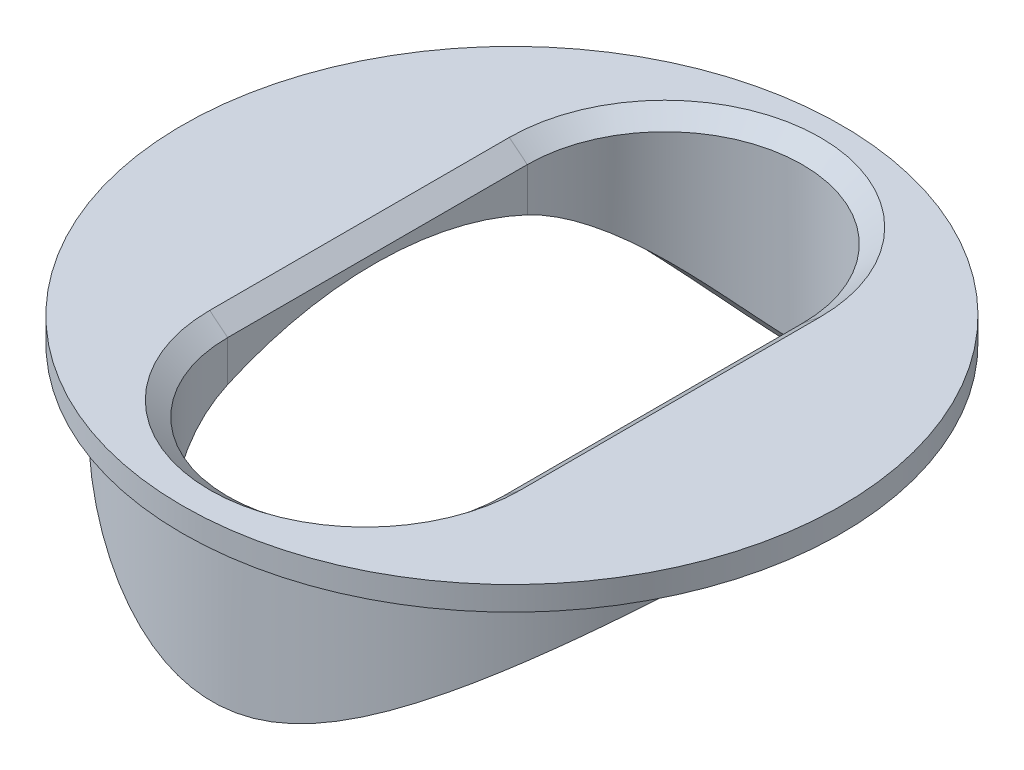
ISO-10303-21;
HEADER;
FILE_DESCRIPTION(('STEP AP214'),'2;1');
FILE_NAME('part.step','',(''),(''),'','','');
FILE_SCHEMA(('AUTOMOTIVE_DESIGN { 1 0 10303 214 1 1 1 1 }'));
ENDSEC;
DATA;
#1=APPLICATION_CONTEXT('core data for automotive mechanical design processes');
#2=APPLICATION_PROTOCOL_DEFINITION('international standard','automotive_design',2000,#1);
#3=PRODUCT_CONTEXT('',#1,'mechanical');
#4=PRODUCT('Part','Part','',(#3));
#5=PRODUCT_RELATED_PRODUCT_CATEGORY('part','',(#4));
#6=PRODUCT_DEFINITION_FORMATION('','',#4);
#7=PRODUCT_DEFINITION_CONTEXT('part definition',#1,'design');
#8=PRODUCT_DEFINITION('design','',#6,#7);
#9=PRODUCT_DEFINITION_SHAPE('','',#8);
#10=(LENGTH_UNIT() NAMED_UNIT(*) SI_UNIT(.MILLI.,.METRE.));
#11=(NAMED_UNIT(*) PLANE_ANGLE_UNIT() SI_UNIT($,.RADIAN.));
#12=(NAMED_UNIT(*) SI_UNIT($,.STERADIAN.) SOLID_ANGLE_UNIT());
#13=UNCERTAINTY_MEASURE_WITH_UNIT(LENGTH_MEASURE(1.E-05),#10,'distance_accuracy_value','');
#14=(GEOMETRIC_REPRESENTATION_CONTEXT(3) GLOBAL_UNCERTAINTY_ASSIGNED_CONTEXT((#13)) GLOBAL_UNIT_ASSIGNED_CONTEXT((#10,
#11,#12)) REPRESENTATION_CONTEXT('',''));
#15=CARTESIAN_POINT('',(0.,0.,0.));
#16=DIRECTION('',(0.,0.,1.));
#17=DIRECTION('',(1.,0.,0.));
#18=AXIS2_PLACEMENT_3D('',#15,#16,#17);
#19=CARTESIAN_POINT('',(0.,5.,0.));
#20=DIRECTION('',(0.,-1.,0.));
#21=DIRECTION('',(0.,0.,-1.));
#22=AXIS2_PLACEMENT_3D('',#19,#20,#21);
#23=CYLINDRICAL_SURFACE('',#22,5.);
#24=CARTESIAN_POINT('',(0.,5.,0.));
#25=DIRECTION('',(0.,1.,0.));
#26=DIRECTION('',(0.,0.,1.));
#27=AXIS2_PLACEMENT_3D('',#24,#25,#26);
#28=CIRCLE('',#27,5.);
#29=CARTESIAN_POINT('',(5.,5.,0.));
#30=VERTEX_POINT('',#29);
#31=CARTESIAN_POINT('',(-5.00000000000002,5.00000000000002,0.));
#32=VERTEX_POINT('',#31);
#33=EDGE_CURVE('E104',#30,#32,#28,.T.);
#34=ORIENTED_EDGE('',*,*,#33,.F.);
#35=CARTESIAN_POINT('',(5.,5.,0.));
#36=CARTESIAN_POINT('',(5.0000064862677,5.00000636279643,-0.118803401095405));
#37=CARTESIAN_POINT('',(4.99576243276274,4.9964675633917,-0.237558182871218));
#38=CARTESIAN_POINT('',(4.97888342242901,4.98241218121961,-0.474087838067091));
#39=CARTESIAN_POINT('',(4.96624750352265,4.97189479839916,-0.591862597565708));
#40=CARTESIAN_POINT('',(4.93280067838579,4.94410935213455,-0.825474733693953));
#41=CARTESIAN_POINT('',(4.9119867768663,4.92683881527392,-0.941311384241482));
#42=CARTESIAN_POINT('',(4.86255145148515,4.88593383048318,-1.17018155731566));
#43=CARTESIAN_POINT('',(4.83392655878944,4.86229655516696,-1.28321381003106));
#44=CARTESIAN_POINT('',(4.73740362240781,4.78287450226039,-1.61550772291657));
#45=CARTESIAN_POINT('',(4.65860789353558,4.71836951829061,-1.82964493287683));
#46=CARTESIAN_POINT('',(4.47594785576944,4.57056793109677,-2.23973970904936));
#47=CARTESIAN_POINT('',(4.37207507698347,4.48726497939233,-2.43569110189251));
#48=CARTESIAN_POINT('',(4.17931765246547,4.33520303254702,-2.7487493551036));
#49=CARTESIAN_POINT('',(4.09605321766379,4.27015451867263,-2.87121824175386));
#50=CARTESIAN_POINT('',(3.92057491487891,4.13495608214751,-3.10654667374618));
#51=CARTESIAN_POINT('',(3.82836116355909,4.06480622600091,-3.21940634431806));
#52=CARTESIAN_POINT('',(3.63553308278675,3.92066908923446,-3.43568816068562));
#53=CARTESIAN_POINT('',(3.53489678957743,3.84667197890407,-3.53908406033977));
#54=CARTESIAN_POINT('',(3.32600704379389,3.69649318853079,-3.73607907111508));
#55=CARTESIAN_POINT('',(3.21775455132494,3.62031178455679,-3.82967941338621));
#56=CARTESIAN_POINT('',(2.99186847524311,3.46590940619064,-4.00872533168449));
#57=CARTESIAN_POINT('',(2.87409893732901,3.38767669457347,-4.09398918746846));
#58=CARTESIAN_POINT('',(2.63097870098595,3.23240914046916,-4.25431125048952));
#59=CARTESIAN_POINT('',(2.50562548412932,3.15537470670733,-4.32936604026974));
#60=CARTESIAN_POINT('',(2.24746866950541,3.0050115613057,-4.46882104937819));
#61=CARTESIAN_POINT('',(2.11468364253878,2.93167441297209,-4.53324636625595));
#62=CARTESIAN_POINT('',(1.84110422364287,2.79155403229088,-4.65107409789267));
#63=CARTESIAN_POINT('',(1.70031678782893,2.72476524134072,-4.70448590476211));
#64=CARTESIAN_POINT('',(1.39667622874439,2.59583630496641,-4.8038705578035));
#65=CARTESIAN_POINT('',(1.23299156369287,2.53471789619366,-4.8486776643058));
#66=CARTESIAN_POINT('',(0.896180811817696,2.43187191424553,-4.92202476595886));
#67=CARTESIAN_POINT('',(0.723078773763431,2.39009732197607,-4.95060424437364));
#68=CARTESIAN_POINT('',(0.457661896369308,2.34688431376343,-4.97982440219376));
#69=CARTESIAN_POINT('',(0.367618679010188,2.33571370000033,-4.98729261982802));
#70=CARTESIAN_POINT('',(0.186635888055952,2.3206515347262,-4.99733565959028));
#71=CARTESIAN_POINT('',(0.095696399075067,2.31675930257913,-4.99991093928053));
#72=CARTESIAN_POINT('',(-0.0861953552895069,2.31649708247112,-5.00008454722765));
#73=CARTESIAN_POINT('',(-0.177147620700307,2.32012711072076,-4.99768286475912));
#74=CARTESIAN_POINT('',(-0.358199787378119,2.33469045716225,-4.98797701095387));
#75=CARTESIAN_POINT('',(-0.448299583463619,2.34562466496004,-4.9806722424497));
#76=CARTESIAN_POINT('',(-0.634290345987522,2.37538324774709,-4.9605577711742));
#77=CARTESIAN_POINT('',(-0.730044329719768,2.3947851529219,-4.94734291419499));
#78=CARTESIAN_POINT('',(-0.919072038911221,2.44038747060614,-4.9157405398429));
#79=CARTESIAN_POINT('',(-1.01234395824117,2.46659269219059,-4.89734936269663));
#80=CARTESIAN_POINT('',(-1.28826795172829,2.55374344299518,-4.83487145070514));
#81=CARTESIAN_POINT('',(-1.46664526370663,2.62315426397916,-4.78352415648848));
#82=CARTESIAN_POINT('',(-1.77568076874676,2.76004871810486,-4.67632227850057));
#83=CARTESIAN_POINT('',(-1.90862269999419,2.82500795712383,-4.62355194613133));
#84=CARTESIAN_POINT('',(-2.16730339944136,2.96043831206373,-4.50808681272012));
#85=CARTESIAN_POINT('',(-2.29303788433664,3.03091264789804,-4.44538619181528));
#86=CARTESIAN_POINT('',(-2.53766285158917,3.17491879023624,-4.31043075762212));
#87=CARTESIAN_POINT('',(-2.65654383781025,3.24845460689311,-4.23816312441515));
#88=CARTESIAN_POINT('',(-2.88743564285202,3.39652708661221,-4.08435401417139));
#89=CARTESIAN_POINT('',(-2.99944783455588,3.47106354601934,-4.00281439970954));
#90=CARTESIAN_POINT('',(-3.22226109628928,3.62342077684068,-3.82600354374306));
#91=CARTESIAN_POINT('',(-3.33269201981388,3.70120929265264,-3.73023700414124));
#92=CARTESIAN_POINT('',(-3.54559939981486,3.85446404087318,-3.52848927170201));
#93=CARTESIAN_POINT('',(-3.64807467199064,3.92992992652313,-3.42250656330085));
#94=CARTESIAN_POINT('',(-3.84425294796649,4.07681645366273,-3.20056123189973));
#95=CARTESIAN_POINT('',(-3.93797365950211,4.14824514018382,-3.08461970676717));
#96=CARTESIAN_POINT('',(-4.11599426421235,4.28566109460446,-2.84274064052496));
#97=CARTESIAN_POINT('',(-4.20029381312783,4.35164816363854,-2.71680273442447));
#98=CARTESIAN_POINT('',(-4.39878554184217,4.50853314592501,-2.38827463214803));
#99=CARTESIAN_POINT('',(-4.50631929530225,4.59498946786027,-2.17932731194452));
#100=CARTESIAN_POINT('',(-4.64613821914312,4.7084038705407,-1.8513717036081));
#101=CARTESIAN_POINT('',(-4.68917312218695,4.74350440601256,-1.73959798407546));
#102=CARTESIAN_POINT('',(-4.76751793421716,4.80764297166477,-1.51170856686385));
#103=CARTESIAN_POINT('',(-4.80283171060456,4.83668403661189,-1.39559507719868));
#104=CARTESIAN_POINT('',(-4.86543453319277,4.88830518104936,-1.15874024023432));
#105=CARTESIAN_POINT('',(-4.89265476556204,4.91082981449133,-1.03796855116843));
#106=CARTESIAN_POINT('',(-4.93816722227972,4.94855722519953,-0.793680719841944));
#107=CARTESIAN_POINT('',(-4.9564638664516,4.96376362711192,-0.670165967971713));
#108=CARTESIAN_POINT('',(-4.98377697031546,4.98648272603519,-0.421443909131275));
#109=CARTESIAN_POINT('',(-4.99279601788868,4.99399756851713,-0.296237084023912));
#110=CARTESIAN_POINT('',(-5.00137053830483,5.00114166173048,-0.0452813606587532));
#111=CARTESIAN_POINT('',(-5.00092704086014,5.00077177047715,0.0804674771283918));
#112=CARTESIAN_POINT('',(-4.9912131909085,4.99267919208227,0.316217699577991));
#113=CARTESIAN_POINT('',(-4.98300958868131,4.98584511760915,0.426296149457824));
#114=CARTESIAN_POINT('',(-4.95942180024422,4.96622340308935,0.645178571447259));
#115=CARTESIAN_POINT('',(-4.94403538382096,4.95343391393135,0.753982136950653));
#116=CARTESIAN_POINT('',(-4.90632392627914,4.922153588973,0.969508932578345));
#117=CARTESIAN_POINT('',(-4.88400108118507,4.90366455762227,1.07623280976896));
#118=CARTESIAN_POINT('',(-4.83274114539643,4.86132925877314,1.28701083316512));
#119=CARTESIAN_POINT('',(-4.80380153552005,4.83748095091222,1.39106394571243));
#120=CARTESIAN_POINT('',(-4.70677908129298,4.75780997966539,1.70100357204864));
#121=CARTESIAN_POINT('',(-4.62897463511253,4.69426548906173,1.90197317990273));
#122=CARTESIAN_POINT('',(-4.45119251532421,4.55070829820292,2.28736622034062));
#123=CARTESIAN_POINT('',(-4.35120664535608,4.47068951124314,2.47178350112441));
#124=CARTESIAN_POINT('',(-4.16241303362757,4.32196402989804,2.77431022087587));
#125=CARTESIAN_POINT('',(-4.07807881363138,4.25618753965956,2.89671891082123));
#126=CARTESIAN_POINT('',(-3.90043631108394,4.11958730343164,3.13182124456801));
#127=CARTESIAN_POINT('',(-3.8071276888363,4.04876336641404,3.24451452031805));
#128=CARTESIAN_POINT('',(-3.61204642318573,3.90332909910819,3.46039828484842));
#129=CARTESIAN_POINT('',(-3.51024916115611,3.82870801884464,3.5635591655786));
#130=CARTESIAN_POINT('',(-3.29899388009149,3.67738428016308,3.75997885952875));
#131=CARTESIAN_POINT('',(-3.18953694443025,3.60068191705467,3.85323906840847));
#132=CARTESIAN_POINT('',(-2.96121350414877,3.44540721169772,4.03144708201688));
#133=CARTESIAN_POINT('',(-2.84221365304651,3.3668259708409,4.11621624228699));
#134=CARTESIAN_POINT('',(-2.59654816531046,3.21106013919063,4.27543853436326));
#135=CARTESIAN_POINT('',(-2.46987979366073,3.13387605960317,4.34988795406829));
#136=CARTESIAN_POINT('',(-2.20902653418021,2.98352281099523,4.48797579821677));
#137=CARTESIAN_POINT('',(-2.07486275313425,2.91034341321279,4.55164272839413));
#138=CARTESIAN_POINT('',(-1.79841659242433,2.77095158572992,4.66777738062599));
#139=CARTESIAN_POINT('',(-1.65614180525609,2.70473280033071,4.72025536508449));
#140=CARTESIAN_POINT('',(-1.35146946258281,2.57850891369613,4.81674752553354));
#141=CARTESIAN_POINT('',(-1.18836978046224,2.51940536010279,4.85976816309609));
#142=CARTESIAN_POINT('',(-0.853057506761583,2.42087013106355,4.92964324178358));
#143=CARTESIAN_POINT('',(-0.680868858020006,2.38138936984465,4.95653805629938));
#144=CARTESIAN_POINT('',(-0.417267118823405,2.34161185607347,4.98335884043903));
#145=CARTESIAN_POINT('',(-0.327939885729355,2.33159299706687,4.9900439743412));
#146=CARTESIAN_POINT('',(-0.148522532583938,2.31874657694375,4.99859875462369));
#147=CARTESIAN_POINT('',(-0.058432477219266,2.31591841207014,5.00046880529626));
#148=CARTESIAN_POINT('',(0.121644228189409,2.31763235091844,4.99933140644563));
#149=CARTESIAN_POINT('',(0.211630875727309,2.32217462964556,4.99632384110741));
#150=CARTESIAN_POINT('',(0.390705731690935,2.33836659549378,4.98551920595953));
#151=CARTESIAN_POINT('',(0.479793444537635,2.3500200062847,4.97771962684741));
#152=CARTESIAN_POINT('',(0.665670000297211,2.38139896959306,4.95646386284238));
#153=CARTESIAN_POINT('',(0.762277582327926,2.40184751901396,4.94249693749092));
#154=CARTESIAN_POINT('',(0.952897655384549,2.44956299936088,4.90931375512976));
#155=CARTESIAN_POINT('',(1.0469082017716,2.47683489368278,4.89009367595844));
#156=CARTESIAN_POINT('',(1.32490519247802,2.56715037769762,4.82502893529808));
#157=CARTESIAN_POINT('',(1.50447425917309,2.6386203494625,4.77182601328659));
#158=CARTESIAN_POINT('',(1.81560530153227,2.77905708413608,4.66101333620414));
#159=CARTESIAN_POINT('',(1.94948557461559,2.84555788327452,4.60651894445034));
#160=CARTESIAN_POINT('',(2.2098947178368,2.98390215298828,4.48741065580201));
#161=CARTESIAN_POINT('',(2.33641925480245,3.05574871700043,4.42279087534715));
#162=CARTESIAN_POINT('',(2.5824750393764,3.20230923095867,4.28378589016389));
#163=CARTESIAN_POINT('',(2.70199665984665,3.27702690475068,4.20938767793865));
#164=CARTESIAN_POINT('',(2.93399936330057,3.42725084654705,4.05109347216149));
#165=CARTESIAN_POINT('',(3.0464818589428,3.50275695275141,3.96719939385687));
#166=CARTESIAN_POINT('',(3.26970299172246,3.65661946215908,3.7855972859226));
#167=CARTESIAN_POINT('',(3.38008420704471,3.73493356113398,3.6874129720634));
#168=CARTESIAN_POINT('',(3.59266286414693,3.88895347699911,3.48062708656673));
#169=CARTESIAN_POINT('',(3.69485901563602,3.96465888158806,3.37202387840541));
#170=CARTESIAN_POINT('',(3.89018127821457,4.11169145947056,3.14465963115798));
#171=CARTESIAN_POINT('',(3.98332637820863,4.1830276775675,3.02592088507467));
#172=CARTESIAN_POINT('',(4.15984718243081,4.31988980472138,2.77827797167402));
#173=CARTESIAN_POINT('',(4.24322187964873,4.38541511469401,2.64937275881185));
#174=CARTESIAN_POINT('',(4.43658392581488,4.53880075702302,2.31715775505749));
#175=CARTESIAN_POINT('',(4.54010823809411,4.62226392609454,2.1078590133521));
#176=CARTESIAN_POINT('',(4.67390583373137,4.73103285742108,1.78004652854697));
#177=CARTESIAN_POINT('',(4.71491832045558,4.7645471565668,1.66848545194811));
#178=CARTESIAN_POINT('',(4.78927419077675,4.82552080229896,1.44122911865483));
#179=CARTESIAN_POINT('',(4.8226186393853,4.85298098971731,1.3255344386574));
#180=CARTESIAN_POINT('',(4.90034346391484,4.91714489125081,1.01333234603958));
#181=CARTESIAN_POINT('',(4.93754678243697,4.94804013902009,0.813745597053209));
#182=CARTESIAN_POINT('',(4.98736819813601,4.98946116455115,0.409390797411382));
#183=CARTESIAN_POINT('',(4.99998882825427,4.99998904091734,0.204623282772272));
#184=CARTESIAN_POINT('',(5.,5.,0.));
#185=B_SPLINE_CURVE_WITH_KNOTS('',3,(#35,#36,#37,#38,#39,#40,#41,#42,#43,#44,#45,#46,#47,#48,
#49,#50,#51,#52,#53,#54,#55,#56,#57,#58,#59,#60,#61,#62,#63,#64,#65,#66,#67,#68,#69,#70,#71,#72,
#73,#74,#75,#76,#77,#78,#79,#80,#81,#82,#83,#84,#85,#86,#87,#88,#89,#90,#91,#92,#93,#94,#95,#96,
#97,#98,#99,#100,#101,#102,#103,#104,#105,#106,#107,#108,#109,#110,#111,#112,#113,#114,#115,
#116,#117,#118,#119,#120,#121,#122,#123,#124,#125,#126,#127,#128,#129,#130,#131,#132,#133,#134,
#135,#136,#137,#138,#139,#140,#141,#142,#143,#144,#145,#146,#147,#148,#149,#150,#151,#152,#153,
#154,#155,#156,#157,#158,#159,#160,#161,#162,#163,#164,#165,#166,#167,#168,#169,#170,#171,#172,
#173,#174,#175,#176,#177,#178,#179,#180,#181,#182,#183,#184),.UNSPECIFIED.,.T.,.F.,(4,2,2,2,2,2,
2,2,2,2,2,2,2,2,2,2,2,2,2,2,2,2,2,2,2,2,2,2,2,2,2,2,2,2,2,2,2,2,2,2,2,2,2,2,2,2,2,2,2,2,2,2,2,2,
2,2,2,2,2,2,2,2,2,2,2,2,2,2,2,2,2,2,2,2,4),(0.,0.356198531128419,0.712437905356867,
1.06880787854775,1.42533637270188,2.13333209783898,2.84156728725027,3.32622201622343,
3.81087042808177,4.29682459639559,4.78271761425373,5.27755036039961,5.77254834493272,
6.26636031071477,6.75974940543413,7.29936255278482,7.83765708456692,8.11040822806103,
8.38313386402394,8.65586008771504,8.92861953390792,9.22392701856221,9.51944381892724,
10.1116379066242,10.5823769120489,11.0533928323055,11.5250464324407,11.9966054526408,
12.4928422896337,12.9891528567514,13.484436760364,13.9797387562551,14.7274446962693,
15.1015034988401,15.4753745093337,15.8523389140401,16.2291164194433,16.6057887984766,
16.9824201883012,17.3138076935885,17.6452981608744,17.9766837873554,18.3081957920453,
18.9794342536,19.6509211619365,20.1379627282136,20.6250227371037,21.1135480143903,
21.6020043344423,22.0992028034935,22.5965796576366,23.0926203414622,23.5882040850607,
24.1228614856737,24.6561746412001,24.9262177314022,25.196238147046,25.4662649741992,
25.7364333195518,26.0351569724179,26.3340985560114,26.9331443359533,27.4099325615984,
27.8869988690867,28.3647063284082,28.8423176087132,29.3434029116174,29.844567050611,
30.3446559675372,30.8447963820892,31.5852621624669,31.9553671316834,32.325420666041,
32.9389891607904,33.5524944315665),.UNSPECIFIED.);
#186=EDGE_CURVE('E116',#30,#32,#185,.T.);
#187=ORIENTED_EDGE('',*,*,#186,.T.);
#188=EDGE_LOOP('',(#34,#187));
#189=FACE_BOUND('',#188,.T.);
#190=ADVANCED_FACE('F33',(#189),#23,.T.);
#191=EDGE_CURVE('E123',#32,#30,#28,.T.);
#192=ORIENTED_EDGE('',*,*,#191,.F.);
#193=EDGE_CURVE('E174',#32,#30,#185,.T.);
#194=ORIENTED_EDGE('',*,*,#193,.T.);
#195=EDGE_LOOP('',(#192,#194));
#196=FACE_BOUND('',#195,.T.);
#197=ADVANCED_FACE('F186',(#196),#23,.T.);
#198=CARTESIAN_POINT('',(0.,5.,0.));
#199=DIRECTION('',(0.,1.,0.));
#200=DIRECTION('',(0.,0.,1.));
#201=AXIS2_PLACEMENT_3D('',#198,#199,#200);
#202=PLANE('',#201);
#203=ORIENTED_EDGE('',*,*,#33,.T.);
#204=ORIENTED_EDGE('',*,*,#191,.T.);
#205=EDGE_LOOP('',(#203,#204));
#206=FACE_BOUND('',#205,.T.);
#207=CARTESIAN_POINT('',(0.,5.,0.));
#208=DIRECTION('',(0.,1.,0.));
#209=DIRECTION('',(0.,0.,1.));
#210=AXIS2_PLACEMENT_3D('',#207,#208,#209);
#211=CIRCLE('',#210,5.5);
#212=CARTESIAN_POINT('',(0.,5.,5.5));
#213=VERTEX_POINT('',#212);
#214=EDGE_CURVE('E124',#213,#213,#211,.T.);
#215=ORIENTED_EDGE('',*,*,#214,.F.);
#216=EDGE_LOOP('',(#215));
#217=FACE_BOUND('',#216,.T.);
#218=ADVANCED_FACE('F210',(#206,#217),#202,.F.);
#219=CARTESIAN_POINT('',(0.,5.4,0.));
#220=DIRECTION('',(0.,-1.,0.));
#221=DIRECTION('',(0.,0.,-1.));
#222=AXIS2_PLACEMENT_3D('',#219,#220,#221);
#223=CYLINDRICAL_SURFACE('',#222,5.5);
#224=CARTESIAN_POINT('',(0.,5.4,0.));
#225=DIRECTION('',(0.,1.,0.));
#226=DIRECTION('',(0.,0.,1.));
#227=AXIS2_PLACEMENT_3D('',#224,#225,#226);
#228=CIRCLE('',#227,5.5);
#229=CARTESIAN_POINT('',(0.,5.4,5.5));
#230=VERTEX_POINT('',#229);
#231=EDGE_CURVE('E120',#230,#230,#228,.T.);
#232=ORIENTED_EDGE('',*,*,#231,.F.);
#233=EDGE_LOOP('',(#232));
#234=FACE_BOUND('',#233,.T.);
#235=ORIENTED_EDGE('',*,*,#214,.T.);
#236=EDGE_LOOP('',(#235));
#237=FACE_BOUND('',#236,.T.);
#238=ADVANCED_FACE('F209',(#234,#237),#223,.T.);
#239=CARTESIAN_POINT('',(0.,5.4,0.));
#240=DIRECTION('',(0.,1.,0.));
#241=DIRECTION('',(0.,0.,1.));
#242=AXIS2_PLACEMENT_3D('',#239,#240,#241);
#243=PLANE('',#242);
#244=DIRECTION('',(0.,0.,-1.));
#245=VECTOR('',#244,1.);
#246=CARTESIAN_POINT('',(-2.59525037907764,5.4,-2.55136464734306));
#247=LINE('',#246,#245);
#248=CARTESIAN_POINT('',(-2.59525037907764,5.4,2.44863535265694));
#249=VERTEX_POINT('',#248);
#250=CARTESIAN_POINT('',(-2.59525037907764,5.4,-2.55136464734306));
#251=VERTEX_POINT('',#250);
#252=EDGE_CURVE('E135',#249,#251,#247,.T.);
#253=ORIENTED_EDGE('',*,*,#252,.T.);
#254=CARTESIAN_POINT('',(0.,5.4,-2.55136464734306));
#255=DIRECTION('',(0.,1.,0.));
#256=DIRECTION('',(0.,0.,1.));
#257=AXIS2_PLACEMENT_3D('',#254,#255,#256);
#258=CIRCLE('',#257,2.59525037907764);
#259=CARTESIAN_POINT('',(2.59525037907764,5.4,-2.55136464734307));
#260=VERTEX_POINT('',#259);
#261=EDGE_CURVE('E137',#251,#260,#258,.F.);
#262=ORIENTED_EDGE('',*,*,#261,.T.);
#263=DIRECTION('',(0.,0.,1.));
#264=VECTOR('',#263,1.);
#265=CARTESIAN_POINT('',(2.59525037907764,5.4,2.44863535265694));
#266=LINE('',#265,#264);
#267=CARTESIAN_POINT('',(2.59525037907764,5.4,2.44863535265694));
#268=VERTEX_POINT('',#267);
#269=EDGE_CURVE('E133',#260,#268,#266,.T.);
#270=ORIENTED_EDGE('',*,*,#269,.T.);
#271=CARTESIAN_POINT('',(0.,5.4,2.44863535265694));
#272=DIRECTION('',(0.,1.,0.));
#273=DIRECTION('',(0.,0.,1.));
#274=AXIS2_PLACEMENT_3D('',#271,#272,#273);
#275=CIRCLE('',#274,2.59525037907764);
#276=EDGE_CURVE('E131',#268,#249,#275,.F.);
#277=ORIENTED_EDGE('',*,*,#276,.T.);
#278=EDGE_LOOP('',(#253,#262,#270,#277));
#279=FACE_BOUND('',#278,.T.);
#280=ORIENTED_EDGE('',*,*,#231,.T.);
#281=EDGE_LOOP('',(#280));
#282=FACE_BOUND('',#281,.T.);
#283=ADVANCED_FACE('F160',(#279,#282),#243,.T.);
#284=CARTESIAN_POINT('',(0.,0.,-2.55136464734306));
#285=DIRECTION('',(0.,1.,0.));
#286=DIRECTION('',(0.,0.,1.));
#287=AXIS2_PLACEMENT_3D('',#284,#285,#286);
#288=CYLINDRICAL_SURFACE('',#287,2.29525037907763);
#289=DIRECTION('',(0.,1.,0.));
#290=VECTOR('',#289,1.);
#291=CARTESIAN_POINT('',(2.29525037907763,0.,-2.55136464734307));
#292=LINE('',#291,#290);
#293=CARTESIAN_POINT('',(2.29525037907763,4.43051916820924,-2.55136464734306));
#294=VERTEX_POINT('',#293);
#295=CARTESIAN_POINT('',(2.29525037907763,5.15706479004149,-2.55136464734307));
#296=VERTEX_POINT('',#295);
#297=EDGE_CURVE('E114',#294,#296,#292,.T.);
#298=ORIENTED_EDGE('',*,*,#297,.T.);
#299=CARTESIAN_POINT('',(0.,5.15706479004149,-2.55136464734306));
#300=DIRECTION('',(0.,1.,0.));
#301=DIRECTION('',(0.,0.,1.));
#302=AXIS2_PLACEMENT_3D('',#299,#300,#301);
#303=CIRCLE('',#302,2.29525037907763);
#304=CARTESIAN_POINT('',(-2.29525037907763,5.15706479004149,-2.55136464734306));
#305=VERTEX_POINT('',#304);
#306=EDGE_CURVE('E103',#296,#305,#303,.T.);
#307=ORIENTED_EDGE('',*,*,#306,.T.);
#308=DIRECTION('',(0.,1.,0.));
#309=VECTOR('',#308,1.);
#310=CARTESIAN_POINT('',(-2.29525037907763,0.,-2.55136464734306));
#311=LINE('',#310,#309);
#312=CARTESIAN_POINT('',(-2.29525037907763,4.43051916820924,-2.55136464734306));
#313=VERTEX_POINT('',#312);
#314=EDGE_CURVE('E112',#313,#305,#311,.T.);
#315=ORIENTED_EDGE('',*,*,#314,.F.);
#316=CARTESIAN_POINT('',(-2.29525037907763,4.43051916820924,-2.55136464734306));
#317=CARTESIAN_POINT('',(-2.29525335025145,4.39620186796268,-2.62444202068726));
#318=CARTESIAN_POINT('',(-2.2917615001124,4.36040119528848,-2.6967782175643));
#319=CARTESIAN_POINT('',(-2.27822958170328,4.28622836254285,-2.83940089480922));
#320=CARTESIAN_POINT('',(-2.26819651711961,4.24785899216204,-2.90968948356014));
#321=CARTESIAN_POINT('',(-2.24212045834311,4.16916704880064,-3.04728698432986));
#322=CARTESIAN_POINT('',(-2.22612336883835,4.12886139230954,-3.11461437314361));
#323=CARTESIAN_POINT('',(-2.18852497335979,4.0464027516079,-3.24651757055802));
#324=CARTESIAN_POINT('',(-2.16692214957301,4.00424926965167,-3.3110926284137));
#325=CARTESIAN_POINT('',(-2.09449865688582,3.87597370773243,-3.49969635205522));
#326=CARTESIAN_POINT('',(-2.03592120072797,3.78762554696735,-3.61931450742285));
#327=CARTESIAN_POINT('',(-1.90012327698981,3.60779890639601,-3.84567040822402));
#328=CARTESIAN_POINT('',(-1.82282843028627,3.51630921976551,-3.95235415115466));
#329=CARTESIAN_POINT('',(-1.68693021536082,3.37228825664181,-4.10965501995945));
#330=CARTESIAN_POINT('',(-1.63404651070494,3.31948023740183,-4.16504797685474));
#331=CARTESIAN_POINT('',(-1.52238173492456,3.21495150138455,-4.27079666912524));
#332=CARTESIAN_POINT('',(-1.46359812885614,3.16323126362556,-4.32115022055887));
#333=CARTESIAN_POINT('',(-1.34022609879084,3.06214371970172,-4.41630973253719));
#334=CARTESIAN_POINT('',(-1.27565596422925,3.01276970569506,-4.46113217704608));
#335=CARTESIAN_POINT('',(-1.14036626325273,2.9176739898862,-4.54486931149559));
#336=CARTESIAN_POINT('',(-1.06965310481865,2.87194857543907,-4.58379004402118));
#337=CARTESIAN_POINT('',(-0.919892152847727,2.78495703951571,-4.6558959989221));
#338=CARTESIAN_POINT('',(-0.840680643864654,2.74383034089891,-4.68891423455736));
#339=CARTESIAN_POINT('',(-0.675504628696171,2.67029205881426,-4.74669857117462));
#340=CARTESIAN_POINT('',(-0.58955230415699,2.63786520197971,-4.7714791526439));
#341=CARTESIAN_POINT('',(-0.425275433182064,2.58916080451344,-4.80819288712655));
#342=CARTESIAN_POINT('',(-0.347778906470833,2.57117721446966,-4.82150677775272));
#343=CARTESIAN_POINT('',(-0.19012153905649,2.54594031774732,-4.84009961087566));
#344=CARTESIAN_POINT('',(-0.109963548765775,2.5386758872776,-4.84538688314766));
#345=CARTESIAN_POINT('',(0.0508727207624994,2.53583217615187,-4.84746283559265));
#346=CARTESIAN_POINT('',(0.131551785334209,2.54028084008846,-4.84423119168293));
#347=CARTESIAN_POINT('',(0.29075365676445,2.5603033769949,-4.82953248933188));
#348=CARTESIAN_POINT('',(0.369274251938394,2.57588824955793,-4.81805728840278));
#349=CARTESIAN_POINT('',(0.542860721807393,2.6217866641119,-4.78368809718686));
#350=CARTESIAN_POINT('',(0.636720602455655,2.6549282378564,-4.75855797013424));
#351=CARTESIAN_POINT('',(0.816659034587591,2.73178993252973,-4.69852375101119));
#352=CARTESIAN_POINT('',(0.902718112501254,2.77553557717073,-4.66359604405161));
#353=CARTESIAN_POINT('',(1.10952126223477,2.89434989034213,-4.56536988944529));
#354=CARTESIAN_POINT('',(1.22512966516292,2.9739031080366,-4.49674888746282));
#355=CARTESIAN_POINT('',(1.43948642488187,3.14039310557528,-4.34396360318532));
#356=CARTESIAN_POINT('',(1.53820068584413,3.22734429896635,-4.25976858523681));
#357=CARTESIAN_POINT('',(1.72353916035092,3.40766438734611,-4.07309774149397));
#358=CARTESIAN_POINT('',(1.80937786201631,3.50114290311652,-3.96994908316369));
#359=CARTESIAN_POINT('',(1.96225367001091,3.6863109256982,-3.74955170043409));
#360=CARTESIAN_POINT('',(2.02933516120727,3.77800416985684,-3.63233721628409));
#361=CARTESIAN_POINT('',(2.11902928491282,3.91892051543158,-3.4368708528813));
#362=CARTESIAN_POINT('',(2.14849086517951,3.96982153909829,-3.36290521802615));
#363=CARTESIAN_POINT('',(2.19990417358974,4.06933517115642,-3.21093175522471));
#364=CARTESIAN_POINT('',(2.22185808129216,4.1179484401675,-3.13292510801363));
#365=CARTESIAN_POINT('',(2.25775238034042,4.21265741362341,-2.97269384960182));
#366=CARTESIAN_POINT('',(2.27162626028727,4.2587294724771,-2.89044013392524));
#367=CARTESIAN_POINT('',(2.29038407568863,4.34740187678837,-2.72293479466189));
#368=CARTESIAN_POINT('',(2.29525419539209,4.38999679121135,-2.63767876811126));
#369=CARTESIAN_POINT('',(2.29525037907763,4.43051916820924,-2.55136464734307));
#370=B_SPLINE_CURVE_WITH_KNOTS('',3,(#316,#317,#318,#319,#320,#321,#322,#323,#324,#325,#326,
#327,#328,#329,#330,#331,#332,#333,#334,#335,#336,#337,#338,#339,#340,#341,#342,#343,#344,#345,
#346,#347,#348,#349,#350,#351,#352,#353,#354,#355,#356,#357,#358,#359,#360,#361,#362,#363,#364,
#365,#366,#367,#368,#369),.UNSPECIFIED.,.F.,.F.,(4,2,2,2,2,2,2,2,2,2,2,2,2,2,2,2,2,2,2,2,2,2,2,
2,2,2,4),(0.,0.242050586730106,0.483842434273978,0.723810409051729,0.963843425664441,
1.44143741288091,1.92096133808623,2.19975808263318,2.47867513163599,2.75673976834563,
3.0345177522348,3.31921390265672,3.60340692296833,3.84437804532494,4.08509892397394,
4.32639462413949,4.56792898990681,4.87419896961168,5.18121358344528,5.64732250455113,
6.11436131059097,6.60333388686232,7.09113943053899,7.37428079012052,7.65733988076995,
7.94269721267017,8.22849204668548),.UNSPECIFIED.);
#371=EDGE_CURVE('E101',#313,#294,#370,.T.);
#372=ORIENTED_EDGE('',*,*,#371,.T.);
#373=EDGE_LOOP('',(#298,#307,#315,#372));
#374=FACE_BOUND('',#373,.T.);
#375=ADVANCED_FACE('F170',(#374),#288,.F.);
#376=CARTESIAN_POINT('',(2.29525037907763,0.,-2.55136464734307));
#377=DIRECTION('',(1.,0.,0.));
#378=DIRECTION('',(0.,0.,-1.));
#379=AXIS2_PLACEMENT_3D('',#376,#377,#378);
#380=PLANE('',#379);
#381=DIRECTION('',(0.,1.,0.));
#382=VECTOR('',#381,1.);
#383=CARTESIAN_POINT('',(2.29525037907763,0.,2.44863535265694));
#384=LINE('',#383,#382);
#385=CARTESIAN_POINT('',(2.29525037907763,4.47760758997198,2.44863535265694));
#386=VERTEX_POINT('',#385);
#387=CARTESIAN_POINT('',(2.29525037907763,5.15706479004149,2.44863535265694));
#388=VERTEX_POINT('',#387);
#389=EDGE_CURVE('E108',#386,#388,#384,.T.);
#390=ORIENTED_EDGE('',*,*,#389,.T.);
#391=DIRECTION('',(0.,0.,-1.));
#392=VECTOR('',#391,1.);
#393=CARTESIAN_POINT('',(2.29525037907763,5.15706479004149,-2.55136464734307));
#394=LINE('',#393,#392);
#395=EDGE_CURVE('E42',#388,#296,#394,.T.);
#396=ORIENTED_EDGE('',*,*,#395,.T.);
#397=ORIENTED_EDGE('',*,*,#297,.F.);
#398=CARTESIAN_POINT('',(2.29525037907763,-1.,0.));
#399=DIRECTION('',(1.,0.,0.));
#400=DIRECTION('',(0.,0.,-1.));
#401=AXIS2_PLACEMENT_3D('',#398,#399,#400);
#402=CIRCLE('',#401,6.);
#403=EDGE_CURVE('E109',#294,#386,#402,.T.);
#404=ORIENTED_EDGE('',*,*,#403,.T.);
#405=EDGE_LOOP('',(#390,#396,#397,#404));
#406=FACE_BOUND('',#405,.T.);
#407=ADVANCED_FACE('F193',(#406),#380,.F.);
#408=CARTESIAN_POINT('',(0.,0.,2.44863535265694));
#409=DIRECTION('',(0.,1.,0.));
#410=DIRECTION('',(0.,0.,1.));
#411=AXIS2_PLACEMENT_3D('',#408,#409,#410);
#412=CYLINDRICAL_SURFACE('',#411,2.29525037907763);
#413=DIRECTION('',(0.,1.,0.));
#414=VECTOR('',#413,1.);
#415=CARTESIAN_POINT('',(-2.29525037907763,0.,2.44863535265694));
#416=LINE('',#415,#414);
#417=CARTESIAN_POINT('',(-2.29525037907763,4.47760758997198,2.44863535265693));
#418=VERTEX_POINT('',#417);
#419=CARTESIAN_POINT('',(-2.29525037907763,5.15706479004149,2.44863535265694));
#420=VERTEX_POINT('',#419);
#421=EDGE_CURVE('E107',#418,#420,#416,.T.);
#422=ORIENTED_EDGE('',*,*,#421,.T.);
#423=CARTESIAN_POINT('',(0.,5.15706479004149,2.44863535265694));
#424=DIRECTION('',(0.,1.,0.));
#425=DIRECTION('',(0.,0.,1.));
#426=AXIS2_PLACEMENT_3D('',#423,#424,#425);
#427=CIRCLE('',#426,2.29525037907763);
#428=EDGE_CURVE('E11',#420,#388,#427,.T.);
#429=ORIENTED_EDGE('',*,*,#428,.T.);
#430=ORIENTED_EDGE('',*,*,#389,.F.);
#431=CARTESIAN_POINT('',(2.29525037907763,4.47760758997198,2.44863535265694));
#432=CARTESIAN_POINT('',(2.29525400882974,4.44527492729429,2.52099790151252));
#433=CARTESIAN_POINT('',(2.29182936470295,4.4114987087465,2.59267426663155));
#434=CARTESIAN_POINT('',(2.27853507711464,4.34143416592839,2.73409160873543));
#435=CARTESIAN_POINT('',(2.26867203777224,4.30514844981086,2.80383449263492));
#436=CARTESIAN_POINT('',(2.24300273031781,4.23063899318272,2.94048296906318));
#437=CARTESIAN_POINT('',(2.22723935753363,4.19243092298715,3.00740525163091));
#438=CARTESIAN_POINT('',(2.19015442733814,4.11420101014359,3.13859655429744));
#439=CARTESIAN_POINT('',(2.16883143408655,4.07417870115529,3.20286488400615));
#440=CARTESIAN_POINT('',(2.09727709593998,3.95229701774927,3.39071026767938));
#441=CARTESIAN_POINT('',(2.03932622495419,3.86824783822862,3.51000807512084));
#442=CARTESIAN_POINT('',(1.90483505459847,3.69711803412188,3.73594086986291));
#443=CARTESIAN_POINT('',(1.82822637467405,3.61002729171402,3.8425270783224));
#444=CARTESIAN_POINT('',(1.69393241777753,3.47344258910689,3.99926309596576));
#445=CARTESIAN_POINT('',(1.64199634462872,3.42366467420154,4.05418005685597));
#446=CARTESIAN_POINT('',(1.53238912031288,3.32515763037198,4.15910846108444));
#447=CARTESIAN_POINT('',(1.47471580869557,3.27642890500356,4.20911804228023));
#448=CARTESIAN_POINT('',(1.35374628238034,3.18118203845643,4.30374382450471));
#449=CARTESIAN_POINT('',(1.29046545910011,3.13465835321511,4.34837404092169));
#450=CARTESIAN_POINT('',(1.15803399496244,3.04502171332761,4.43187846227587));
#451=CARTESIAN_POINT('',(1.08888870512844,3.00190571729546,4.47075782753067));
#452=CARTESIAN_POINT('',(0.938045861222802,2.91712139574857,4.54528519790769));
#453=CARTESIAN_POINT('',(0.855778810572495,2.87592520986951,4.58033567336614));
#454=CARTESIAN_POINT('',(0.684198192026351,2.80256596508668,4.64141975834141));
#455=CARTESIAN_POINT('',(0.594897926817501,2.77038635392829,4.66746991105051));
#456=CARTESIAN_POINT('',(0.424531802415662,2.72252392460087,4.70570019378009));
#457=CARTESIAN_POINT('',(0.34431979564672,2.70506237164867,4.71939974519062));
#458=CARTESIAN_POINT('',(0.181298849965498,2.68101761549752,4.73818041049467));
#459=CARTESIAN_POINT('',(0.0984924561379232,2.67442407150578,4.74326971706486));
#460=CARTESIAN_POINT('',(-0.0674481964875348,2.67296897183002,4.74439677530537));
#461=CARTESIAN_POINT('',(-0.150582779154801,2.67812961102927,4.74041740299877));
#462=CARTESIAN_POINT('',(-0.314519880005217,2.69953159802907,4.72373153199503));
#463=CARTESIAN_POINT('',(-0.395320044051812,2.71578375057946,4.71101652343462));
#464=CARTESIAN_POINT('',(-0.574255960917395,2.76323006551909,4.67324678792145));
#465=CARTESIAN_POINT('',(-0.671106109048719,2.79729129293528,4.64577170801268));
#466=CARTESIAN_POINT('',(-0.85662116556732,2.87598137550707,4.5803264141374));
#467=CARTESIAN_POINT('',(-0.94526612025271,2.92063509748579,4.54233146821507));
#468=CARTESIAN_POINT('',(-1.15457301414743,3.0397445291918,4.43727042157587));
#469=CARTESIAN_POINT('',(-1.27029084296598,3.1182443269661,4.36498875901723));
#470=CARTESIAN_POINT('',(-1.48440985825612,3.28210561948551,4.20438234349845));
#471=CARTESIAN_POINT('',(-1.58277888201309,3.36747944001686,4.11602839749918));
#472=CARTESIAN_POINT('',(-1.76586203401851,3.54335706624,3.92119862812204));
#473=CARTESIAN_POINT('',(-1.8499035681071,3.63393175782615,3.8141555032751));
#474=CARTESIAN_POINT('',(-1.99833769581948,3.81274785358026,3.58586102335604));
#475=CARTESIAN_POINT('',(-2.06277725045601,3.90099436428394,3.46464460467182));
#476=CARTESIAN_POINT('',(-2.14469800738571,4.03160404775101,3.26949581833747));
#477=CARTESIAN_POINT('',(-2.17001015620912,4.07602572764247,3.20014004010827));
#478=CARTESIAN_POINT('',(-2.21409162166593,4.16281795141697,3.05814088363487));
#479=CARTESIAN_POINT('',(-2.23286278433983,4.20518907111097,2.98549843952516));
#480=CARTESIAN_POINT('',(-2.26346434928354,4.287686692043,2.8368342825067));
#481=CARTESIAN_POINT('',(-2.27524619551922,4.32779577804423,2.76079278679684));
#482=CARTESIAN_POINT('',(-2.29114628816606,4.40505283614751,2.60632569484846));
#483=CARTESIAN_POINT('',(-2.29525484456013,4.44219700752798,2.52789721104199));
#484=CARTESIAN_POINT('',(-2.29525037907763,4.47760758997198,2.44863535265694));
#485=B_SPLINE_CURVE_WITH_KNOTS('',3,(#431,#432,#433,#434,#435,#436,#437,#438,#439,#440,#441,
#442,#443,#444,#445,#446,#447,#448,#449,#450,#451,#452,#453,#454,#455,#456,#457,#458,#459,#460,
#461,#462,#463,#464,#465,#466,#467,#468,#469,#470,#471,#472,#473,#474,#475,#476,#477,#478,#479,
#480,#481,#482,#483,#484),.UNSPECIFIED.,.F.,.F.,(4,2,2,2,2,2,2,2,2,2,2,2,2,2,2,2,2,2,2,2,2,2,2,
2,2,2,4),(0.,0.237627198646389,0.475011035779956,0.710701596497724,0.946453087595432,
1.41561761542965,1.88652820599913,2.15776938581964,2.42911309535957,2.69973382160649,
2.97011022353662,3.26460269076193,3.55855094501897,3.80716859850284,4.05554955813945,
4.30439991284518,4.55349303072554,4.87055381585504,5.18836642699047,5.65805895383665,
6.12861328778631,6.61730774577942,7.10482203279765,7.36303367627183,7.62117238640808,
7.88108404580283,8.14132370661171),.UNSPECIFIED.);
#486=EDGE_CURVE('E98',#386,#418,#485,.T.);
#487=ORIENTED_EDGE('',*,*,#486,.T.);
#488=EDGE_LOOP('',(#422,#429,#430,#487));
#489=FACE_BOUND('',#488,.T.);
#490=ADVANCED_FACE('F106',(#489),#412,.F.);
#491=CARTESIAN_POINT('',(-2.29525037907763,0.,-2.55136464734306));
#492=DIRECTION('',(-1.,0.,0.));
#493=DIRECTION('',(0.,0.,1.));
#494=AXIS2_PLACEMENT_3D('',#491,#492,#493);
#495=PLANE('',#494);
#496=ORIENTED_EDGE('',*,*,#314,.T.);
#497=DIRECTION('',(0.,0.,1.));
#498=VECTOR('',#497,1.);
#499=CARTESIAN_POINT('',(-2.29525037907763,5.15706479004149,2.44863535265694));
#500=LINE('',#499,#498);
#501=EDGE_CURVE('E56',#305,#420,#500,.T.);
#502=ORIENTED_EDGE('',*,*,#501,.T.);
#503=ORIENTED_EDGE('',*,*,#421,.F.);
#504=CARTESIAN_POINT('',(-2.29525037907763,-1.,0.));
#505=DIRECTION('',(-1.,0.,0.));
#506=DIRECTION('',(0.,0.,1.));
#507=AXIS2_PLACEMENT_3D('',#504,#505,#506);
#508=CIRCLE('',#507,6.);
#509=EDGE_CURVE('E94',#418,#313,#508,.T.);
#510=ORIENTED_EDGE('',*,*,#509,.T.);
#511=EDGE_LOOP('',(#496,#502,#503,#510));
#512=FACE_BOUND('',#511,.T.);
#513=ADVANCED_FACE('F111',(#512),#495,.F.);
#514=CARTESIAN_POINT('',(-5.5,-1.,0.));
#515=DIRECTION('',(1.,0.,0.));
#516=DIRECTION('',(0.,0.,-1.));
#517=AXIS2_PLACEMENT_3D('',#514,#515,#516);
#518=CYLINDRICAL_SURFACE('',#517,6.);
#519=ORIENTED_EDGE('',*,*,#509,.F.);
#520=ORIENTED_EDGE('',*,*,#486,.F.);
#521=ORIENTED_EDGE('',*,*,#403,.F.);
#522=ORIENTED_EDGE('',*,*,#371,.F.);
#523=EDGE_LOOP('',(#519,#520,#521,#522));
#524=FACE_BOUND('',#523,.T.);
#525=ORIENTED_EDGE('',*,*,#193,.F.);
#526=ORIENTED_EDGE('',*,*,#186,.F.);
#527=EDGE_LOOP('',(#525,#526));
#528=FACE_BOUND('',#527,.T.);
#529=ADVANCED_FACE('F96',(#524,#528),#518,.F.);
#530=CARTESIAN_POINT('',(0.,5.15706479004149,2.44863535265694));
#531=DIRECTION('',(0.,1.,0.));
#532=DIRECTION('',(0.,0.,1.));
#533=AXIS2_PLACEMENT_3D('',#530,#531,#532);
#534=CONICAL_SURFACE('',#533,2.29525037907763,0.89011791851711);
#535=DIRECTION('',(0.777145961456972,-0.629320391049836,0.));
#536=VECTOR('',#535,1.);
#537=CARTESIAN_POINT('',(-2.59525037907764,5.4,2.44863535265694));
#538=LINE('',#537,#536);
#539=EDGE_CURVE('E145',#249,#420,#538,.T.);
#540=ORIENTED_EDGE('',*,*,#539,.F.);
#541=ORIENTED_EDGE('',*,*,#276,.F.);
#542=DIRECTION('',(0.777145961456972,0.629320391049836,0.));
#543=VECTOR('',#542,1.);
#544=CARTESIAN_POINT('',(2.29525037907763,5.15706479004149,2.44863535265694));
#545=LINE('',#544,#543);
#546=EDGE_CURVE('E37',#388,#268,#545,.T.);
#547=ORIENTED_EDGE('',*,*,#546,.F.);
#548=ORIENTED_EDGE('',*,*,#428,.F.);
#549=EDGE_LOOP('',(#540,#541,#547,#548));
#550=FACE_BOUND('',#549,.T.);
#551=ADVANCED_FACE('F35',(#550),#534,.F.);
#552=CARTESIAN_POINT('',(2.29525037907763,5.15706479004149,-2.55136464734307));
#553=DIRECTION('',(-0.629320391049836,0.777145961456972,0.));
#554=DIRECTION('',(-0.777145961456972,-0.629320391049836,0.));
#555=AXIS2_PLACEMENT_3D('',#552,#553,#554);
#556=PLANE('',#555);
#557=ORIENTED_EDGE('',*,*,#546,.T.);
#558=ORIENTED_EDGE('',*,*,#269,.F.);
#559=DIRECTION('',(0.777145961456972,0.629320391049836,0.));
#560=VECTOR('',#559,1.);
#561=CARTESIAN_POINT('',(2.29525037907763,5.15706479004149,-2.55136464734307));
#562=LINE('',#561,#560);
#563=EDGE_CURVE('E144',#296,#260,#562,.T.);
#564=ORIENTED_EDGE('',*,*,#563,.F.);
#565=ORIENTED_EDGE('',*,*,#395,.F.);
#566=EDGE_LOOP('',(#557,#558,#564,#565));
#567=FACE_BOUND('',#566,.T.);
#568=ADVANCED_FACE('F155',(#567),#556,.T.);
#569=CARTESIAN_POINT('',(-2.29525037907763,5.15706479004149,-2.55136464734306));
#570=DIRECTION('',(0.629320391049836,0.777145961456972,0.));
#571=DIRECTION('',(-0.777145961456972,0.629320391049836,0.));
#572=AXIS2_PLACEMENT_3D('',#569,#570,#571);
#573=PLANE('',#572);
#574=ORIENTED_EDGE('',*,*,#539,.T.);
#575=ORIENTED_EDGE('',*,*,#501,.F.);
#576=DIRECTION('',(0.777145961456972,-0.629320391049836,0.));
#577=VECTOR('',#576,1.);
#578=CARTESIAN_POINT('',(-2.59525037907764,5.4,-2.55136464734306));
#579=LINE('',#578,#577);
#580=EDGE_CURVE('E142',#251,#305,#579,.T.);
#581=ORIENTED_EDGE('',*,*,#580,.F.);
#582=ORIENTED_EDGE('',*,*,#252,.F.);
#583=EDGE_LOOP('',(#574,#575,#581,#582));
#584=FACE_BOUND('',#583,.T.);
#585=ADVANCED_FACE('F167',(#584),#573,.T.);
#586=CARTESIAN_POINT('',(0.,5.15706479004149,-2.55136464734306));
#587=DIRECTION('',(0.,1.,0.));
#588=DIRECTION('',(0.,0.,1.));
#589=AXIS2_PLACEMENT_3D('',#586,#587,#588);
#590=CONICAL_SURFACE('',#589,2.29525037907763,0.89011791851711);
#591=ORIENTED_EDGE('',*,*,#563,.T.);
#592=ORIENTED_EDGE('',*,*,#261,.F.);
#593=ORIENTED_EDGE('',*,*,#580,.T.);
#594=ORIENTED_EDGE('',*,*,#306,.F.);
#595=EDGE_LOOP('',(#591,#592,#593,#594));
#596=FACE_BOUND('',#595,.T.);
#597=ADVANCED_FACE('F165',(#596),#590,.F.);
#598=CLOSED_SHELL('',(#190,#197,#218,#238,#283,#375,#407,#490,#513,#529,#551,#568,#585,#597));
#599=MANIFOLD_SOLID_BREP('B2',#598);
#600=ADVANCED_BREP_SHAPE_REPRESENTATION('',(#18,#599),#14);
#601=SHAPE_DEFINITION_REPRESENTATION(#9,#600);
ENDSEC;
END-ISO-10303-21;
